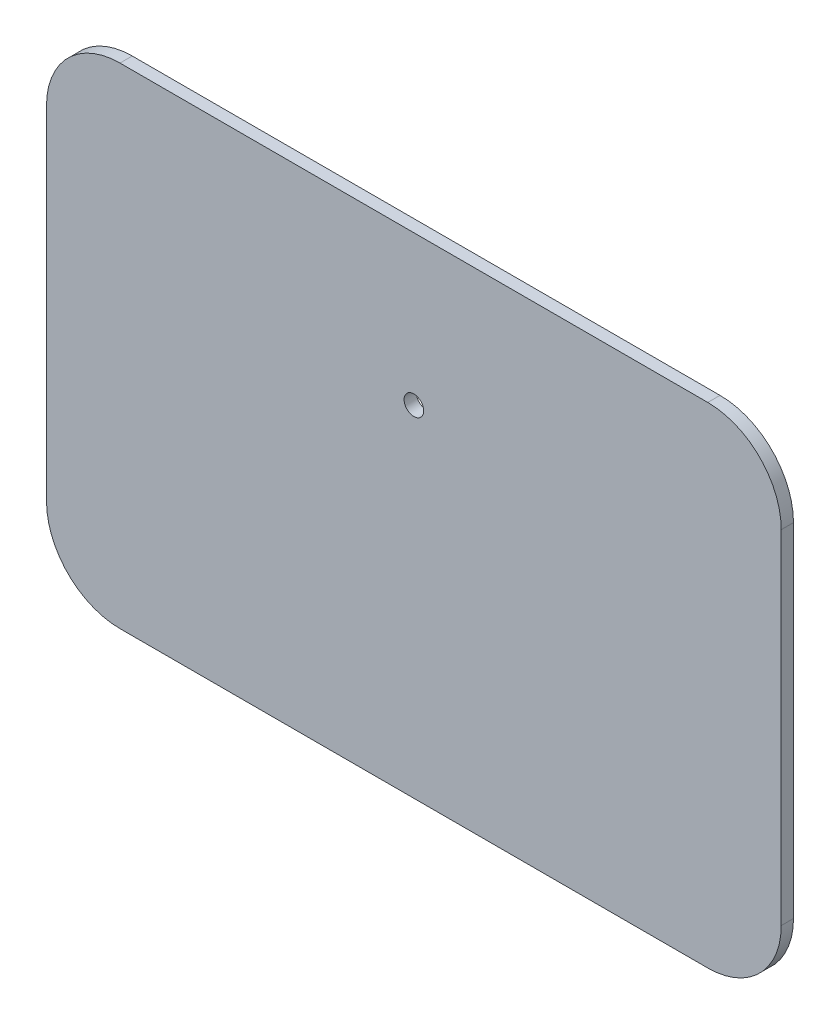
ISO-10303-21;
HEADER;
FILE_DESCRIPTION(('STEP AP214'),'2;1');
FILE_NAME('part.step','',(''),(''),'','','');
FILE_SCHEMA(('AUTOMOTIVE_DESIGN { 1 0 10303 214 1 1 1 1 }'));
ENDSEC;
DATA;
#1=APPLICATION_CONTEXT('core data for automotive mechanical design processes');
#2=APPLICATION_PROTOCOL_DEFINITION('international standard','automotive_design',2000,#1);
#3=PRODUCT_CONTEXT('',#1,'mechanical');
#4=PRODUCT('Part','Part','',(#3));
#5=PRODUCT_RELATED_PRODUCT_CATEGORY('part','',(#4));
#6=PRODUCT_DEFINITION_FORMATION('','',#4);
#7=PRODUCT_DEFINITION_CONTEXT('part definition',#1,'design');
#8=PRODUCT_DEFINITION('design','',#6,#7);
#9=PRODUCT_DEFINITION_SHAPE('','',#8);
#10=(LENGTH_UNIT() NAMED_UNIT(*) SI_UNIT(.MILLI.,.METRE.));
#11=(NAMED_UNIT(*) PLANE_ANGLE_UNIT() SI_UNIT($,.RADIAN.));
#12=(NAMED_UNIT(*) SI_UNIT($,.STERADIAN.) SOLID_ANGLE_UNIT());
#13=UNCERTAINTY_MEASURE_WITH_UNIT(LENGTH_MEASURE(1.E-05),#10,'distance_accuracy_value','');
#14=(GEOMETRIC_REPRESENTATION_CONTEXT(3) GLOBAL_UNCERTAINTY_ASSIGNED_CONTEXT((#13)) GLOBAL_UNIT_ASSIGNED_CONTEXT((#10,
#11,#12)) REPRESENTATION_CONTEXT('',''));
#15=CARTESIAN_POINT('',(0.,0.,0.));
#16=DIRECTION('',(0.,0.,1.));
#17=DIRECTION('',(1.,0.,0.));
#18=AXIS2_PLACEMENT_3D('',#15,#16,#17);
#19=CARTESIAN_POINT('',(-152.7582583677,0.,5.));
#20=DIRECTION('',(1.,0.,0.));
#21=DIRECTION('',(0.,0.,-1.));
#22=AXIS2_PLACEMENT_3D('',#19,#20,#21);
#23=PLANE('',#22);
#24=DIRECTION('',(0.,-1.,0.));
#25=VECTOR('',#24,1.);
#26=CARTESIAN_POINT('',(-152.7582583677,0.,0.));
#27=LINE('',#26,#25);
#28=CARTESIAN_POINT('',(-152.7582583677,86.1622497998398,0.));
#29=VERTEX_POINT('',#28);
#30=CARTESIAN_POINT('',(-152.7582583677,-53.8377502001601,0.));
#31=VERTEX_POINT('',#30);
#32=EDGE_CURVE('E131',#29,#31,#27,.T.);
#33=ORIENTED_EDGE('',*,*,#32,.T.);
#34=DIRECTION('',(0.,0.,-1.));
#35=VECTOR('',#34,1.);
#36=CARTESIAN_POINT('',(-152.7582583677,-53.8377502001601,5.));
#37=LINE('',#36,#35);
#38=CARTESIAN_POINT('',(-152.7582583677,-53.8377502001601,5.));
#39=VERTEX_POINT('',#38);
#40=EDGE_CURVE('E11',#39,#31,#37,.T.);
#41=ORIENTED_EDGE('',*,*,#40,.F.);
#42=DIRECTION('',(0.,-1.,0.));
#43=VECTOR('',#42,1.);
#44=CARTESIAN_POINT('',(-152.7582583677,0.,5.));
#45=LINE('',#44,#43);
#46=CARTESIAN_POINT('',(-152.7582583677,86.1622497998398,5.));
#47=VERTEX_POINT('',#46);
#48=EDGE_CURVE('E146',#47,#39,#45,.T.);
#49=ORIENTED_EDGE('',*,*,#48,.F.);
#50=DIRECTION('',(0.,0.,-1.));
#51=VECTOR('',#50,1.);
#52=CARTESIAN_POINT('',(-152.7582583677,86.1622497998398,5.));
#53=LINE('',#52,#51);
#54=EDGE_CURVE('E127',#47,#29,#53,.T.);
#55=ORIENTED_EDGE('',*,*,#54,.T.);
#56=EDGE_LOOP('',(#33,#41,#49,#55));
#57=FACE_BOUND('',#56,.T.);
#58=ADVANCED_FACE('F35',(#57),#23,.F.);
#59=CARTESIAN_POINT('',(-122.7582583677,-53.8377502001601,5.));
#60=DIRECTION('',(0.,0.,-1.));
#61=DIRECTION('',(-1.,0.,0.));
#62=AXIS2_PLACEMENT_3D('',#59,#60,#61);
#63=CYLINDRICAL_SURFACE('',#62,30.);
#64=CARTESIAN_POINT('',(-122.7582583677,-53.8377502001601,0.));
#65=DIRECTION('',(0.,0.,1.));
#66=DIRECTION('',(1.,0.,0.));
#67=AXIS2_PLACEMENT_3D('',#64,#65,#66);
#68=CIRCLE('',#67,30.);
#69=CARTESIAN_POINT('',(-122.7582583677,-83.8377502001601,0.));
#70=VERTEX_POINT('',#69);
#71=EDGE_CURVE('E134',#31,#70,#68,.T.);
#72=ORIENTED_EDGE('',*,*,#71,.T.);
#73=DIRECTION('',(0.,0.,-1.));
#74=VECTOR('',#73,1.);
#75=CARTESIAN_POINT('',(-122.7582583677,-83.8377502001601,5.));
#76=LINE('',#75,#74);
#77=CARTESIAN_POINT('',(-122.7582583677,-83.8377502001601,5.));
#78=VERTEX_POINT('',#77);
#79=EDGE_CURVE('E43',#78,#70,#76,.T.);
#80=ORIENTED_EDGE('',*,*,#79,.F.);
#81=CARTESIAN_POINT('',(-122.7582583677,-53.8377502001601,5.));
#82=DIRECTION('',(0.,0.,1.));
#83=DIRECTION('',(1.,0.,0.));
#84=AXIS2_PLACEMENT_3D('',#81,#82,#83);
#85=CIRCLE('',#84,30.);
#86=EDGE_CURVE('E94',#39,#78,#85,.T.);
#87=ORIENTED_EDGE('',*,*,#86,.F.);
#88=ORIENTED_EDGE('',*,*,#40,.T.);
#89=EDGE_LOOP('',(#72,#80,#87,#88));
#90=FACE_BOUND('',#89,.T.);
#91=ADVANCED_FACE('F200',(#90),#63,.T.);
#92=CARTESIAN_POINT('',(0.,-83.8377502001601,5.));
#93=DIRECTION('',(0.,1.,0.));
#94=DIRECTION('',(0.,0.,1.));
#95=AXIS2_PLACEMENT_3D('',#92,#93,#94);
#96=PLANE('',#95);
#97=DIRECTION('',(1.,0.,0.));
#98=VECTOR('',#97,1.);
#99=CARTESIAN_POINT('',(0.,-83.8377502001601,0.));
#100=LINE('',#99,#98);
#101=CARTESIAN_POINT('',(117.241741632299,-83.8377502001601,0.));
#102=VERTEX_POINT('',#101);
#103=EDGE_CURVE('E137',#70,#102,#100,.T.);
#104=ORIENTED_EDGE('',*,*,#103,.T.);
#105=DIRECTION('',(0.,0.,-1.));
#106=VECTOR('',#105,1.);
#107=CARTESIAN_POINT('',(117.241741632299,-83.8377502001601,5.));
#108=LINE('',#107,#106);
#109=CARTESIAN_POINT('',(117.241741632299,-83.8377502001601,5.));
#110=VERTEX_POINT('',#109);
#111=EDGE_CURVE('E153',#110,#102,#108,.T.);
#112=ORIENTED_EDGE('',*,*,#111,.F.);
#113=DIRECTION('',(1.,0.,0.));
#114=VECTOR('',#113,1.);
#115=CARTESIAN_POINT('',(0.,-83.8377502001601,5.));
#116=LINE('',#115,#114);
#117=EDGE_CURVE('E161',#78,#110,#116,.T.);
#118=ORIENTED_EDGE('',*,*,#117,.F.);
#119=ORIENTED_EDGE('',*,*,#79,.T.);
#120=EDGE_LOOP('',(#104,#112,#118,#119));
#121=FACE_BOUND('',#120,.T.);
#122=ADVANCED_FACE('F159',(#121),#96,.F.);
#123=CARTESIAN_POINT('',(117.2417416323,-53.8377502001601,5.));
#124=DIRECTION('',(0.,0.,-1.));
#125=DIRECTION('',(-1.,0.,0.));
#126=AXIS2_PLACEMENT_3D('',#123,#124,#125);
#127=CYLINDRICAL_SURFACE('',#126,30.);
#128=CARTESIAN_POINT('',(117.2417416323,-53.8377502001601,0.));
#129=DIRECTION('',(0.,0.,1.));
#130=DIRECTION('',(1.,0.,0.));
#131=AXIS2_PLACEMENT_3D('',#128,#129,#130);
#132=CIRCLE('',#131,30.);
#133=CARTESIAN_POINT('',(147.2417416323,-53.8377502001599,0.));
#134=VERTEX_POINT('',#133);
#135=EDGE_CURVE('E139',#102,#134,#132,.T.);
#136=ORIENTED_EDGE('',*,*,#135,.T.);
#137=DIRECTION('',(0.,0.,-1.));
#138=VECTOR('',#137,1.);
#139=CARTESIAN_POINT('',(147.2417416323,-53.8377502001599,5.));
#140=LINE('',#139,#138);
#141=CARTESIAN_POINT('',(147.2417416323,-53.8377502001599,5.));
#142=VERTEX_POINT('',#141);
#143=EDGE_CURVE('E150',#142,#134,#140,.T.);
#144=ORIENTED_EDGE('',*,*,#143,.F.);
#145=CARTESIAN_POINT('',(117.2417416323,-53.8377502001601,5.));
#146=DIRECTION('',(0.,0.,1.));
#147=DIRECTION('',(1.,0.,0.));
#148=AXIS2_PLACEMENT_3D('',#145,#146,#147);
#149=CIRCLE('',#148,30.);
#150=EDGE_CURVE('E173',#110,#142,#149,.T.);
#151=ORIENTED_EDGE('',*,*,#150,.F.);
#152=ORIENTED_EDGE('',*,*,#111,.T.);
#153=EDGE_LOOP('',(#136,#144,#151,#152));
#154=FACE_BOUND('',#153,.T.);
#155=ADVANCED_FACE('F169',(#154),#127,.T.);
#156=CARTESIAN_POINT('',(147.2417416323,0.,5.));
#157=DIRECTION('',(-1.,0.,0.));
#158=DIRECTION('',(0.,0.,1.));
#159=AXIS2_PLACEMENT_3D('',#156,#157,#158);
#160=PLANE('',#159);
#161=DIRECTION('',(0.,1.,0.));
#162=VECTOR('',#161,1.);
#163=CARTESIAN_POINT('',(147.2417416323,0.,0.));
#164=LINE('',#163,#162);
#165=CARTESIAN_POINT('',(147.2417416323,86.1622497998399,0.));
#166=VERTEX_POINT('',#165);
#167=EDGE_CURVE('E141',#134,#166,#164,.T.);
#168=ORIENTED_EDGE('',*,*,#167,.T.);
#169=DIRECTION('',(0.,0.,-1.));
#170=VECTOR('',#169,1.);
#171=CARTESIAN_POINT('',(147.2417416323,86.1622497998399,5.));
#172=LINE('',#171,#170);
#173=CARTESIAN_POINT('',(147.2417416323,86.1622497998399,5.));
#174=VERTEX_POINT('',#173);
#175=EDGE_CURVE('E122',#174,#166,#172,.T.);
#176=ORIENTED_EDGE('',*,*,#175,.F.);
#177=DIRECTION('',(0.,1.,0.));
#178=VECTOR('',#177,1.);
#179=CARTESIAN_POINT('',(147.2417416323,0.,5.));
#180=LINE('',#179,#178);
#181=EDGE_CURVE('E113',#142,#174,#180,.T.);
#182=ORIENTED_EDGE('',*,*,#181,.F.);
#183=ORIENTED_EDGE('',*,*,#143,.T.);
#184=EDGE_LOOP('',(#168,#176,#182,#183));
#185=FACE_BOUND('',#184,.T.);
#186=ADVANCED_FACE('F172',(#185),#160,.F.);
#187=CARTESIAN_POINT('',(117.2417416323,86.1622497998399,5.));
#188=DIRECTION('',(0.,0.,-1.));
#189=DIRECTION('',(-1.,0.,0.));
#190=AXIS2_PLACEMENT_3D('',#187,#188,#189);
#191=CYLINDRICAL_SURFACE('',#190,30.);
#192=CARTESIAN_POINT('',(117.2417416323,86.1622497998399,0.));
#193=DIRECTION('',(0.,0.,1.));
#194=DIRECTION('',(1.,0.,0.));
#195=AXIS2_PLACEMENT_3D('',#192,#193,#194);
#196=CIRCLE('',#195,30.);
#197=CARTESIAN_POINT('',(117.2417416323,116.16224979984,0.));
#198=VERTEX_POINT('',#197);
#199=EDGE_CURVE('E121',#166,#198,#196,.T.);
#200=ORIENTED_EDGE('',*,*,#199,.T.);
#201=DIRECTION('',(0.,0.,-1.));
#202=VECTOR('',#201,1.);
#203=CARTESIAN_POINT('',(117.2417416323,116.16224979984,5.));
#204=LINE('',#203,#202);
#205=CARTESIAN_POINT('',(117.2417416323,116.16224979984,5.));
#206=VERTEX_POINT('',#205);
#207=EDGE_CURVE('E118',#206,#198,#204,.T.);
#208=ORIENTED_EDGE('',*,*,#207,.F.);
#209=CARTESIAN_POINT('',(117.2417416323,86.1622497998399,5.));
#210=DIRECTION('',(0.,0.,1.));
#211=DIRECTION('',(1.,0.,0.));
#212=AXIS2_PLACEMENT_3D('',#209,#210,#211);
#213=CIRCLE('',#212,30.);
#214=EDGE_CURVE('E107',#174,#206,#213,.T.);
#215=ORIENTED_EDGE('',*,*,#214,.F.);
#216=ORIENTED_EDGE('',*,*,#175,.T.);
#217=EDGE_LOOP('',(#200,#208,#215,#216));
#218=FACE_BOUND('',#217,.T.);
#219=ADVANCED_FACE('F119',(#218),#191,.T.);
#220=CARTESIAN_POINT('',(0.,116.16224979984,5.));
#221=DIRECTION('',(0.,-1.,0.));
#222=DIRECTION('',(0.,0.,-1.));
#223=AXIS2_PLACEMENT_3D('',#220,#221,#222);
#224=PLANE('',#223);
#225=DIRECTION('',(-1.,0.,0.));
#226=VECTOR('',#225,1.);
#227=CARTESIAN_POINT('',(0.,116.16224979984,0.));
#228=LINE('',#227,#226);
#229=CARTESIAN_POINT('',(-122.7582583677,116.16224979984,0.));
#230=VERTEX_POINT('',#229);
#231=EDGE_CURVE('E80',#198,#230,#228,.T.);
#232=ORIENTED_EDGE('',*,*,#231,.T.);
#233=DIRECTION('',(0.,0.,-1.));
#234=VECTOR('',#233,1.);
#235=CARTESIAN_POINT('',(-122.7582583677,116.16224979984,5.));
#236=LINE('',#235,#234);
#237=CARTESIAN_POINT('',(-122.7582583677,116.16224979984,5.));
#238=VERTEX_POINT('',#237);
#239=EDGE_CURVE('E123',#238,#230,#236,.T.);
#240=ORIENTED_EDGE('',*,*,#239,.F.);
#241=DIRECTION('',(-1.,0.,0.));
#242=VECTOR('',#241,1.);
#243=CARTESIAN_POINT('',(0.,116.16224979984,5.));
#244=LINE('',#243,#242);
#245=EDGE_CURVE('E111',#206,#238,#244,.T.);
#246=ORIENTED_EDGE('',*,*,#245,.F.);
#247=ORIENTED_EDGE('',*,*,#207,.T.);
#248=EDGE_LOOP('',(#232,#240,#246,#247));
#249=FACE_BOUND('',#248,.T.);
#250=ADVANCED_FACE('F125',(#249),#224,.F.);
#251=CARTESIAN_POINT('',(-122.7582583677,86.1622497998398,5.));
#252=DIRECTION('',(0.,0.,-1.));
#253=DIRECTION('',(-1.,0.,0.));
#254=AXIS2_PLACEMENT_3D('',#251,#252,#253);
#255=CYLINDRICAL_SURFACE('',#254,30.);
#256=CARTESIAN_POINT('',(-122.7582583677,86.1622497998398,0.));
#257=DIRECTION('',(0.,0.,1.));
#258=DIRECTION('',(1.,0.,0.));
#259=AXIS2_PLACEMENT_3D('',#256,#257,#258);
#260=CIRCLE('',#259,30.);
#261=EDGE_CURVE('E86',#230,#29,#260,.T.);
#262=ORIENTED_EDGE('',*,*,#261,.T.);
#263=ORIENTED_EDGE('',*,*,#54,.F.);
#264=CARTESIAN_POINT('',(-122.7582583677,86.1622497998398,5.));
#265=DIRECTION('',(0.,0.,1.));
#266=DIRECTION('',(1.,0.,0.));
#267=AXIS2_PLACEMENT_3D('',#264,#265,#266);
#268=CIRCLE('',#267,30.);
#269=EDGE_CURVE('E51',#238,#47,#268,.T.);
#270=ORIENTED_EDGE('',*,*,#269,.F.);
#271=ORIENTED_EDGE('',*,*,#239,.T.);
#272=EDGE_LOOP('',(#262,#263,#270,#271));
#273=FACE_BOUND('',#272,.T.);
#274=ADVANCED_FACE('F195',(#273),#255,.T.);
#275=CARTESIAN_POINT('',(0.,0.,5.));
#276=DIRECTION('',(0.,0.,1.));
#277=DIRECTION('',(1.,0.,0.));
#278=AXIS2_PLACEMENT_3D('',#275,#276,#277);
#279=PLANE('',#278);
#280=CARTESIAN_POINT('',(-2.75825836770044,55.1622497998399,5.));
#281=DIRECTION('',(0.,0.,1.));
#282=DIRECTION('',(1.,0.,0.));
#283=AXIS2_PLACEMENT_3D('',#280,#281,#282);
#284=CIRCLE('',#283,4.);
#285=CARTESIAN_POINT('',(1.24174163229956,55.1622497998399,5.));
#286=VERTEX_POINT('',#285);
#287=EDGE_CURVE('E135',#286,#286,#284,.T.);
#288=ORIENTED_EDGE('',*,*,#287,.F.);
#289=EDGE_LOOP('',(#288));
#290=FACE_BOUND('',#289,.T.);
#291=ORIENTED_EDGE('',*,*,#48,.T.);
#292=ORIENTED_EDGE('',*,*,#86,.T.);
#293=ORIENTED_EDGE('',*,*,#117,.T.);
#294=ORIENTED_EDGE('',*,*,#150,.T.);
#295=ORIENTED_EDGE('',*,*,#181,.T.);
#296=ORIENTED_EDGE('',*,*,#214,.T.);
#297=ORIENTED_EDGE('',*,*,#245,.T.);
#298=ORIENTED_EDGE('',*,*,#269,.T.);
#299=EDGE_LOOP('',(#291,#292,#293,#294,#295,#296,#297,#298));
#300=FACE_BOUND('',#299,.T.);
#301=ADVANCED_FACE('F109',(#290,#300),#279,.T.);
#302=CARTESIAN_POINT('',(0.,0.,0.));
#303=DIRECTION('',(0.,0.,1.));
#304=DIRECTION('',(1.,0.,0.));
#305=AXIS2_PLACEMENT_3D('',#302,#303,#304);
#306=PLANE('',#305);
#307=CARTESIAN_POINT('',(-2.75825836770044,55.1622497998399,0.));
#308=DIRECTION('',(0.,0.,-1.));
#309=DIRECTION('',(-1.,0.,0.));
#310=AXIS2_PLACEMENT_3D('',#307,#308,#309);
#311=CIRCLE('',#310,4.);
#312=CARTESIAN_POINT('',(-6.75825836770044,55.1622497998399,0.));
#313=VERTEX_POINT('',#312);
#314=EDGE_CURVE('E181',#313,#313,#311,.T.);
#315=ORIENTED_EDGE('',*,*,#314,.F.);
#316=EDGE_LOOP('',(#315));
#317=FACE_BOUND('',#316,.T.);
#318=ORIENTED_EDGE('',*,*,#32,.F.);
#319=ORIENTED_EDGE('',*,*,#261,.F.);
#320=ORIENTED_EDGE('',*,*,#231,.F.);
#321=ORIENTED_EDGE('',*,*,#199,.F.);
#322=ORIENTED_EDGE('',*,*,#167,.F.);
#323=ORIENTED_EDGE('',*,*,#135,.F.);
#324=ORIENTED_EDGE('',*,*,#103,.F.);
#325=ORIENTED_EDGE('',*,*,#71,.F.);
#326=EDGE_LOOP('',(#318,#319,#320,#321,#322,#323,#324,#325));
#327=FACE_BOUND('',#326,.T.);
#328=ADVANCED_FACE('F165',(#317,#327),#306,.F.);
#329=CARTESIAN_POINT('',(-2.75825836770044,55.1622497998399,10.));
#330=DIRECTION('',(0.,0.,-1.));
#331=DIRECTION('',(-1.,0.,0.));
#332=AXIS2_PLACEMENT_3D('',#329,#330,#331);
#333=CYLINDRICAL_SURFACE('',#332,4.);
#334=ORIENTED_EDGE('',*,*,#287,.T.);
#335=EDGE_LOOP('',(#334));
#336=FACE_BOUND('',#335,.T.);
#337=ORIENTED_EDGE('',*,*,#314,.T.);
#338=EDGE_LOOP('',(#337));
#339=FACE_BOUND('',#338,.T.);
#340=ADVANCED_FACE('F185',(#336,#339),#333,.F.);
#341=CLOSED_SHELL('',(#58,#91,#122,#155,#186,#219,#250,#274,#301,#328,#340));
#342=MANIFOLD_SOLID_BREP('B2',#341);
#343=ADVANCED_BREP_SHAPE_REPRESENTATION('',(#18,#342),#14);
#344=SHAPE_DEFINITION_REPRESENTATION(#9,#343);
ENDSEC;
END-ISO-10303-21;
